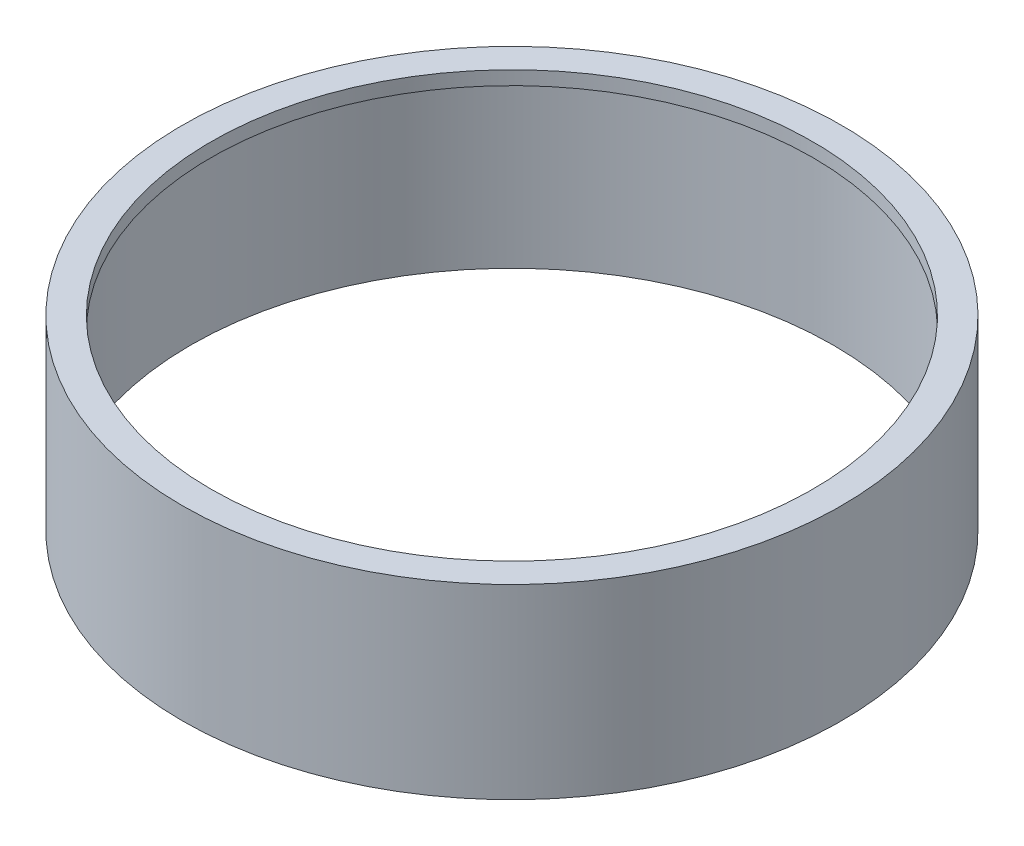
ISO-10303-21;
HEADER;
FILE_DESCRIPTION(('STEP AP214'),'2;1');
FILE_NAME('part.step','',(''),(''),'','','');
FILE_SCHEMA(('AUTOMOTIVE_DESIGN { 1 0 10303 214 1 1 1 1 }'));
ENDSEC;
DATA;
#1=APPLICATION_CONTEXT('core data for automotive mechanical design processes');
#2=APPLICATION_PROTOCOL_DEFINITION('international standard','automotive_design',2000,#1);
#3=PRODUCT_CONTEXT('',#1,'mechanical');
#4=PRODUCT('Part','Part','',(#3));
#5=PRODUCT_RELATED_PRODUCT_CATEGORY('part','',(#4));
#6=PRODUCT_DEFINITION_FORMATION('','',#4);
#7=PRODUCT_DEFINITION_CONTEXT('part definition',#1,'design');
#8=PRODUCT_DEFINITION('design','',#6,#7);
#9=PRODUCT_DEFINITION_SHAPE('','',#8);
#10=(LENGTH_UNIT() NAMED_UNIT(*) SI_UNIT(.MILLI.,.METRE.));
#11=(NAMED_UNIT(*) PLANE_ANGLE_UNIT() SI_UNIT($,.RADIAN.));
#12=(NAMED_UNIT(*) SI_UNIT($,.STERADIAN.) SOLID_ANGLE_UNIT());
#13=UNCERTAINTY_MEASURE_WITH_UNIT(LENGTH_MEASURE(1.E-05),#10,'distance_accuracy_value','');
#14=(GEOMETRIC_REPRESENTATION_CONTEXT(3) GLOBAL_UNCERTAINTY_ASSIGNED_CONTEXT((#13)) GLOBAL_UNIT_ASSIGNED_CONTEXT((#10,
#11,#12)) REPRESENTATION_CONTEXT('',''));
#15=CARTESIAN_POINT('',(0.,0.,0.));
#16=DIRECTION('',(0.,0.,1.));
#17=DIRECTION('',(1.,0.,0.));
#18=AXIS2_PLACEMENT_3D('',#15,#16,#17);
#19=CARTESIAN_POINT('',(0.,22.62,0.));
#20=DIRECTION('',(0.,-1.,0.));
#21=DIRECTION('',(0.,0.,-1.));
#22=AXIS2_PLACEMENT_3D('',#19,#20,#21);
#23=CYLINDRICAL_SURFACE('',#22,40.);
#24=CARTESIAN_POINT('',(0.,22.62,0.));
#25=DIRECTION('',(0.,1.,0.));
#26=DIRECTION('',(0.,0.,1.));
#27=AXIS2_PLACEMENT_3D('',#24,#25,#26);
#28=CIRCLE('',#27,40.);
#29=CARTESIAN_POINT('',(0.,22.62,40.));
#30=VERTEX_POINT('',#29);
#31=EDGE_CURVE('E10',#30,#30,#28,.T.);
#32=ORIENTED_EDGE('',*,*,#31,.F.);
#33=EDGE_LOOP('',(#32));
#34=FACE_BOUND('',#33,.T.);
#35=CARTESIAN_POINT('',(0.,0.,0.));
#36=DIRECTION('',(0.,1.,0.));
#37=DIRECTION('',(0.,0.,1.));
#38=AXIS2_PLACEMENT_3D('',#35,#36,#37);
#39=CIRCLE('',#38,40.);
#40=CARTESIAN_POINT('',(0.,0.,40.));
#41=VERTEX_POINT('',#40);
#42=EDGE_CURVE('E49',#41,#41,#39,.T.);
#43=ORIENTED_EDGE('',*,*,#42,.T.);
#44=EDGE_LOOP('',(#43));
#45=FACE_BOUND('',#44,.T.);
#46=ADVANCED_FACE('F41',(#34,#45),#23,.T.);
#47=CARTESIAN_POINT('',(0.,22.62,0.));
#48=DIRECTION('',(0.,1.,0.));
#49=DIRECTION('',(0.,0.,1.));
#50=AXIS2_PLACEMENT_3D('',#47,#48,#49);
#51=PLANE('',#50);
#52=CARTESIAN_POINT('',(0.,22.62,0.));
#53=DIRECTION('',(0.,1.,0.));
#54=DIRECTION('',(0.,0.,1.));
#55=AXIS2_PLACEMENT_3D('',#52,#53,#54);
#56=CIRCLE('',#55,36.525);
#57=CARTESIAN_POINT('',(0.,22.62,36.525));
#58=VERTEX_POINT('',#57);
#59=EDGE_CURVE('E64',#58,#58,#56,.T.);
#60=ORIENTED_EDGE('',*,*,#59,.F.);
#61=EDGE_LOOP('',(#60));
#62=FACE_BOUND('',#61,.T.);
#63=ORIENTED_EDGE('',*,*,#31,.T.);
#64=EDGE_LOOP('',(#63));
#65=FACE_BOUND('',#64,.T.);
#66=ADVANCED_FACE('F90',(#62,#65),#51,.T.);
#67=CARTESIAN_POINT('',(0.,0.,0.));
#68=DIRECTION('',(0.,1.,0.));
#69=DIRECTION('',(0.,0.,1.));
#70=AXIS2_PLACEMENT_3D('',#67,#68,#69);
#71=PLANE('',#70);
#72=CARTESIAN_POINT('',(0.,0.,0.));
#73=DIRECTION('',(0.,-1.,0.));
#74=DIRECTION('',(0.,0.,-1.));
#75=AXIS2_PLACEMENT_3D('',#72,#73,#74);
#76=CIRCLE('',#75,39.);
#77=CARTESIAN_POINT('',(0.,0.,-39.));
#78=VERTEX_POINT('',#77);
#79=EDGE_CURVE('E57',#78,#78,#76,.T.);
#80=ORIENTED_EDGE('',*,*,#79,.F.);
#81=EDGE_LOOP('',(#80));
#82=FACE_BOUND('',#81,.T.);
#83=ORIENTED_EDGE('',*,*,#42,.F.);
#84=EDGE_LOOP('',(#83));
#85=FACE_BOUND('',#84,.T.);
#86=ADVANCED_FACE('F84',(#82,#85),#71,.F.);
#87=CARTESIAN_POINT('',(0.,20.95,0.));
#88=DIRECTION('',(0.,-1.,0.));
#89=DIRECTION('',(0.,0.,-1.));
#90=AXIS2_PLACEMENT_3D('',#87,#88,#89);
#91=CYLINDRICAL_SURFACE('',#90,39.);
#92=CARTESIAN_POINT('',(0.,20.95,0.));
#93=DIRECTION('',(0.,-1.,0.));
#94=DIRECTION('',(0.,0.,-1.));
#95=AXIS2_PLACEMENT_3D('',#92,#93,#94);
#96=CIRCLE('',#95,39.);
#97=CARTESIAN_POINT('',(0.,20.95,-39.));
#98=VERTEX_POINT('',#97);
#99=EDGE_CURVE('E55',#98,#98,#96,.T.);
#100=ORIENTED_EDGE('',*,*,#99,.F.);
#101=EDGE_LOOP('',(#100));
#102=FACE_BOUND('',#101,.T.);
#103=ORIENTED_EDGE('',*,*,#79,.T.);
#104=EDGE_LOOP('',(#103));
#105=FACE_BOUND('',#104,.T.);
#106=ADVANCED_FACE('F78',(#102,#105),#91,.F.);
#107=CARTESIAN_POINT('',(0.,20.95,0.));
#108=DIRECTION('',(0.,-1.,0.));
#109=DIRECTION('',(0.,0.,-1.));
#110=AXIS2_PLACEMENT_3D('',#107,#108,#109);
#111=PLANE('',#110);
#112=CARTESIAN_POINT('',(0.,20.95,0.));
#113=DIRECTION('',(0.,-1.,0.));
#114=DIRECTION('',(0.,0.,-1.));
#115=AXIS2_PLACEMENT_3D('',#112,#113,#114);
#116=CIRCLE('',#115,36.525);
#117=CARTESIAN_POINT('',(0.,20.95,-36.525));
#118=VERTEX_POINT('',#117);
#119=EDGE_CURVE('E44',#118,#118,#116,.T.);
#120=ORIENTED_EDGE('',*,*,#119,.F.);
#121=EDGE_LOOP('',(#120));
#122=FACE_BOUND('',#121,.T.);
#123=ORIENTED_EDGE('',*,*,#99,.T.);
#124=EDGE_LOOP('',(#123));
#125=FACE_BOUND('',#124,.T.);
#126=ADVANCED_FACE('F75',(#122,#125),#111,.T.);
#127=CARTESIAN_POINT('',(0.,0.,0.));
#128=DIRECTION('',(0.,1.,0.));
#129=DIRECTION('',(0.,0.,1.));
#130=AXIS2_PLACEMENT_3D('',#127,#128,#129);
#131=CYLINDRICAL_SURFACE('',#130,36.525);
#132=ORIENTED_EDGE('',*,*,#119,.T.);
#133=EDGE_LOOP('',(#132));
#134=FACE_BOUND('',#133,.T.);
#135=ORIENTED_EDGE('',*,*,#59,.T.);
#136=EDGE_LOOP('',(#135));
#137=FACE_BOUND('',#136,.T.);
#138=ADVANCED_FACE('F73',(#134,#137),#131,.F.);
#139=CLOSED_SHELL('',(#46,#66,#86,#106,#126,#138));
#140=MANIFOLD_SOLID_BREP('B2',#139);
#141=ADVANCED_BREP_SHAPE_REPRESENTATION('',(#18,#140),#14);
#142=SHAPE_DEFINITION_REPRESENTATION(#9,#141);
ENDSEC;
END-ISO-10303-21;
